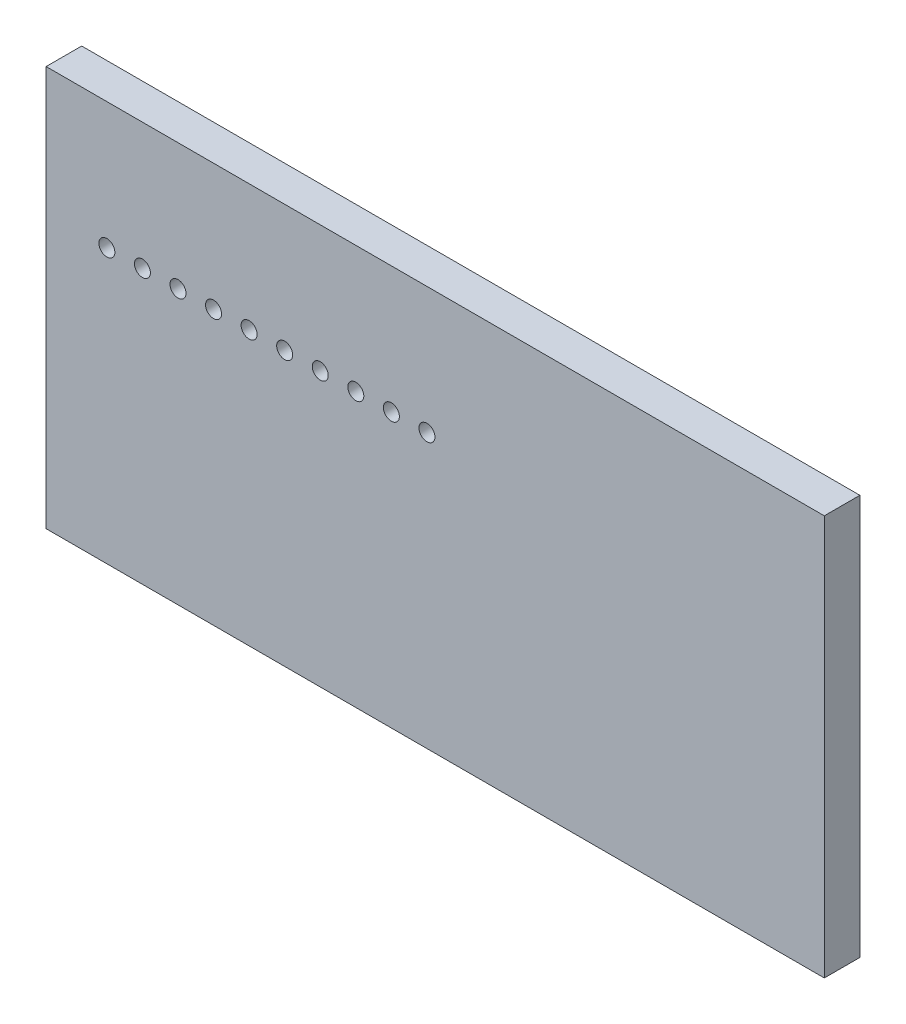
ISO-10303-21;
HEADER;
FILE_DESCRIPTION(('STEP AP214'),'2;1');
FILE_NAME('part.step','',(''),(''),'','','');
FILE_SCHEMA(('AUTOMOTIVE_DESIGN { 1 0 10303 214 1 1 1 1 }'));
ENDSEC;
DATA;
#1=APPLICATION_CONTEXT('core data for automotive mechanical design processes');
#2=APPLICATION_PROTOCOL_DEFINITION('international standard','automotive_design',2000,#1);
#3=PRODUCT_CONTEXT('',#1,'mechanical');
#4=PRODUCT('Part','Part','',(#3));
#5=PRODUCT_RELATED_PRODUCT_CATEGORY('part','',(#4));
#6=PRODUCT_DEFINITION_FORMATION('','',#4);
#7=PRODUCT_DEFINITION_CONTEXT('part definition',#1,'design');
#8=PRODUCT_DEFINITION('design','',#6,#7);
#9=PRODUCT_DEFINITION_SHAPE('','',#8);
#10=(LENGTH_UNIT() NAMED_UNIT(*) SI_UNIT(.MILLI.,.METRE.));
#11=(NAMED_UNIT(*) PLANE_ANGLE_UNIT() SI_UNIT($,.RADIAN.));
#12=(NAMED_UNIT(*) SI_UNIT($,.STERADIAN.) SOLID_ANGLE_UNIT());
#13=UNCERTAINTY_MEASURE_WITH_UNIT(LENGTH_MEASURE(1.E-05),#10,'distance_accuracy_value','');
#14=(GEOMETRIC_REPRESENTATION_CONTEXT(3) GLOBAL_UNCERTAINTY_ASSIGNED_CONTEXT((#13)) GLOBAL_UNIT_ASSIGNED_CONTEXT((#10,
#11,#12)) REPRESENTATION_CONTEXT('',''));
#15=CARTESIAN_POINT('',(0.,0.,0.));
#16=DIRECTION('',(0.,0.,1.));
#17=DIRECTION('',(1.,0.,0.));
#18=AXIS2_PLACEMENT_3D('',#15,#16,#17);
#19=CARTESIAN_POINT('',(-2.33233733232246,20.6904259891092,10.));
#20=DIRECTION('',(0.,0.,1.));
#21=DIRECTION('',(1.,0.,0.));
#22=AXIS2_PLACEMENT_3D('',#19,#20,#21);
#23=CYLINDRICAL_SURFACE('',#22,2.25);
#24=CARTESIAN_POINT('',(-2.33233733232246,20.6904259891092,0.));
#25=DIRECTION('',(0.,0.,1.));
#26=DIRECTION('',(1.,0.,0.));
#27=AXIS2_PLACEMENT_3D('',#24,#25,#26);
#28=CIRCLE('',#27,2.25);
#29=CARTESIAN_POINT('',(-0.0823373323224699,20.6904259891092,0.));
#30=VERTEX_POINT('',#29);
#31=EDGE_CURVE('E43',#30,#30,#28,.T.);
#32=ORIENTED_EDGE('',*,*,#31,.F.);
#33=EDGE_LOOP('',(#32));
#34=FACE_BOUND('',#33,.T.);
#35=CARTESIAN_POINT('',(-2.33233733232246,20.6904259891092,10.));
#36=DIRECTION('',(0.,0.,1.));
#37=DIRECTION('',(1.,0.,0.));
#38=AXIS2_PLACEMENT_3D('',#35,#36,#37);
#39=CIRCLE('',#38,2.24999999999999);
#40=CARTESIAN_POINT('',(-0.0823373323224769,20.6904259891092,10.));
#41=VERTEX_POINT('',#40);
#42=EDGE_CURVE('E11',#41,#41,#39,.T.);
#43=ORIENTED_EDGE('',*,*,#42,.T.);
#44=EDGE_LOOP('',(#43));
#45=FACE_BOUND('',#44,.T.);
#46=ADVANCED_FACE('F35',(#34,#45),#23,.F.);
#47=CARTESIAN_POINT('',(-12.3323373323225,20.6904259891092,10.));
#48=DIRECTION('',(0.,0.,1.));
#49=DIRECTION('',(1.,0.,0.));
#50=AXIS2_PLACEMENT_3D('',#47,#48,#49);
#51=CYLINDRICAL_SURFACE('',#50,2.25);
#52=CARTESIAN_POINT('',(-12.3323373323225,20.6904259891092,0.));
#53=DIRECTION('',(0.,0.,1.));
#54=DIRECTION('',(1.,0.,0.));
#55=AXIS2_PLACEMENT_3D('',#52,#53,#54);
#56=CIRCLE('',#55,2.25);
#57=CARTESIAN_POINT('',(-10.0823373323225,20.6904259891092,0.));
#58=VERTEX_POINT('',#57);
#59=EDGE_CURVE('E149',#58,#58,#56,.T.);
#60=ORIENTED_EDGE('',*,*,#59,.F.);
#61=EDGE_LOOP('',(#60));
#62=FACE_BOUND('',#61,.T.);
#63=CARTESIAN_POINT('',(-12.3323373323225,20.6904259891092,10.));
#64=DIRECTION('',(0.,0.,1.));
#65=DIRECTION('',(1.,0.,0.));
#66=AXIS2_PLACEMENT_3D('',#63,#64,#65);
#67=CIRCLE('',#66,2.24999999999999);
#68=CARTESIAN_POINT('',(-10.0823373323225,20.6904259891092,10.));
#69=VERTEX_POINT('',#68);
#70=EDGE_CURVE('E152',#69,#69,#67,.T.);
#71=ORIENTED_EDGE('',*,*,#70,.T.);
#72=EDGE_LOOP('',(#71));
#73=FACE_BOUND('',#72,.T.);
#74=ADVANCED_FACE('F161',(#62,#73),#51,.F.);
#75=CARTESIAN_POINT('',(-22.3323373323225,20.6904259891092,10.));
#76=DIRECTION('',(0.,0.,1.));
#77=DIRECTION('',(1.,0.,0.));
#78=AXIS2_PLACEMENT_3D('',#75,#76,#77);
#79=CYLINDRICAL_SURFACE('',#78,2.25);
#80=CARTESIAN_POINT('',(-22.3323373323225,20.6904259891092,0.));
#81=DIRECTION('',(0.,0.,1.));
#82=DIRECTION('',(1.,0.,0.));
#83=AXIS2_PLACEMENT_3D('',#80,#81,#82);
#84=CIRCLE('',#83,2.25);
#85=CARTESIAN_POINT('',(-20.0823373323225,20.6904259891092,0.));
#86=VERTEX_POINT('',#85);
#87=EDGE_CURVE('E143',#86,#86,#84,.T.);
#88=ORIENTED_EDGE('',*,*,#87,.F.);
#89=EDGE_LOOP('',(#88));
#90=FACE_BOUND('',#89,.T.);
#91=CARTESIAN_POINT('',(-22.3323373323225,20.6904259891092,10.));
#92=DIRECTION('',(0.,0.,1.));
#93=DIRECTION('',(1.,0.,0.));
#94=AXIS2_PLACEMENT_3D('',#91,#92,#93);
#95=CIRCLE('',#94,2.24999999999999);
#96=CARTESIAN_POINT('',(-20.0823373323225,20.6904259891092,10.));
#97=VERTEX_POINT('',#96);
#98=EDGE_CURVE('E146',#97,#97,#95,.T.);
#99=ORIENTED_EDGE('',*,*,#98,.T.);
#100=EDGE_LOOP('',(#99));
#101=FACE_BOUND('',#100,.T.);
#102=ADVANCED_FACE('F208',(#90,#101),#79,.F.);
#103=CARTESIAN_POINT('',(-32.3323373323225,20.6904259891092,10.));
#104=DIRECTION('',(0.,0.,1.));
#105=DIRECTION('',(1.,0.,0.));
#106=AXIS2_PLACEMENT_3D('',#103,#104,#105);
#107=CYLINDRICAL_SURFACE('',#106,2.25);
#108=CARTESIAN_POINT('',(-32.3323373323225,20.6904259891092,0.));
#109=DIRECTION('',(0.,0.,1.));
#110=DIRECTION('',(1.,0.,0.));
#111=AXIS2_PLACEMENT_3D('',#108,#109,#110);
#112=CIRCLE('',#111,2.25);
#113=CARTESIAN_POINT('',(-30.0823373323225,20.6904259891092,0.));
#114=VERTEX_POINT('',#113);
#115=EDGE_CURVE('E137',#114,#114,#112,.T.);
#116=ORIENTED_EDGE('',*,*,#115,.F.);
#117=EDGE_LOOP('',(#116));
#118=FACE_BOUND('',#117,.T.);
#119=CARTESIAN_POINT('',(-32.3323373323225,20.6904259891092,10.));
#120=DIRECTION('',(0.,0.,1.));
#121=DIRECTION('',(1.,0.,0.));
#122=AXIS2_PLACEMENT_3D('',#119,#120,#121);
#123=CIRCLE('',#122,2.24999999999999);
#124=CARTESIAN_POINT('',(-30.0823373323225,20.6904259891092,10.));
#125=VERTEX_POINT('',#124);
#126=EDGE_CURVE('E140',#125,#125,#123,.T.);
#127=ORIENTED_EDGE('',*,*,#126,.T.);
#128=EDGE_LOOP('',(#127));
#129=FACE_BOUND('',#128,.T.);
#130=ADVANCED_FACE('F204',(#118,#129),#107,.F.);
#131=CARTESIAN_POINT('',(-42.3323373323225,20.6904259891092,10.));
#132=DIRECTION('',(0.,0.,1.));
#133=DIRECTION('',(1.,0.,0.));
#134=AXIS2_PLACEMENT_3D('',#131,#132,#133);
#135=CYLINDRICAL_SURFACE('',#134,2.25);
#136=CARTESIAN_POINT('',(-42.3323373323225,20.6904259891092,0.));
#137=DIRECTION('',(0.,0.,1.));
#138=DIRECTION('',(1.,0.,0.));
#139=AXIS2_PLACEMENT_3D('',#136,#137,#138);
#140=CIRCLE('',#139,2.25);
#141=CARTESIAN_POINT('',(-40.0823373323225,20.6904259891092,0.));
#142=VERTEX_POINT('',#141);
#143=EDGE_CURVE('E131',#142,#142,#140,.T.);
#144=ORIENTED_EDGE('',*,*,#143,.F.);
#145=EDGE_LOOP('',(#144));
#146=FACE_BOUND('',#145,.T.);
#147=CARTESIAN_POINT('',(-42.3323373323225,20.6904259891092,10.));
#148=DIRECTION('',(0.,0.,1.));
#149=DIRECTION('',(1.,0.,0.));
#150=AXIS2_PLACEMENT_3D('',#147,#148,#149);
#151=CIRCLE('',#150,2.24999999999999);
#152=CARTESIAN_POINT('',(-40.0823373323225,20.6904259891092,10.));
#153=VERTEX_POINT('',#152);
#154=EDGE_CURVE('E134',#153,#153,#151,.T.);
#155=ORIENTED_EDGE('',*,*,#154,.T.);
#156=EDGE_LOOP('',(#155));
#157=FACE_BOUND('',#156,.T.);
#158=ADVANCED_FACE('F200',(#146,#157),#135,.F.);
#159=CARTESIAN_POINT('',(-52.3323373323225,20.6904259891092,10.));
#160=DIRECTION('',(0.,0.,1.));
#161=DIRECTION('',(1.,0.,0.));
#162=AXIS2_PLACEMENT_3D('',#159,#160,#161);
#163=CYLINDRICAL_SURFACE('',#162,2.25);
#164=CARTESIAN_POINT('',(-52.3323373323225,20.6904259891092,0.));
#165=DIRECTION('',(0.,0.,1.));
#166=DIRECTION('',(1.,0.,0.));
#167=AXIS2_PLACEMENT_3D('',#164,#165,#166);
#168=CIRCLE('',#167,2.25);
#169=CARTESIAN_POINT('',(-50.0823373323225,20.6904259891092,0.));
#170=VERTEX_POINT('',#169);
#171=EDGE_CURVE('E125',#170,#170,#168,.T.);
#172=ORIENTED_EDGE('',*,*,#171,.F.);
#173=EDGE_LOOP('',(#172));
#174=FACE_BOUND('',#173,.T.);
#175=CARTESIAN_POINT('',(-52.3323373323225,20.6904259891092,10.));
#176=DIRECTION('',(0.,0.,1.));
#177=DIRECTION('',(1.,0.,0.));
#178=AXIS2_PLACEMENT_3D('',#175,#176,#177);
#179=CIRCLE('',#178,2.24999999999999);
#180=CARTESIAN_POINT('',(-50.0823373323225,20.6904259891092,10.));
#181=VERTEX_POINT('',#180);
#182=EDGE_CURVE('E128',#181,#181,#179,.T.);
#183=ORIENTED_EDGE('',*,*,#182,.T.);
#184=EDGE_LOOP('',(#183));
#185=FACE_BOUND('',#184,.T.);
#186=ADVANCED_FACE('F196',(#174,#185),#163,.F.);
#187=CARTESIAN_POINT('',(-62.3323373323225,20.6904259891092,10.));
#188=DIRECTION('',(0.,0.,1.));
#189=DIRECTION('',(1.,0.,0.));
#190=AXIS2_PLACEMENT_3D('',#187,#188,#189);
#191=CYLINDRICAL_SURFACE('',#190,2.25);
#192=CARTESIAN_POINT('',(-62.3323373323225,20.6904259891092,0.));
#193=DIRECTION('',(0.,0.,1.));
#194=DIRECTION('',(1.,0.,0.));
#195=AXIS2_PLACEMENT_3D('',#192,#193,#194);
#196=CIRCLE('',#195,2.25);
#197=CARTESIAN_POINT('',(-60.0823373323225,20.6904259891092,0.));
#198=VERTEX_POINT('',#197);
#199=EDGE_CURVE('E119',#198,#198,#196,.T.);
#200=ORIENTED_EDGE('',*,*,#199,.F.);
#201=EDGE_LOOP('',(#200));
#202=FACE_BOUND('',#201,.T.);
#203=CARTESIAN_POINT('',(-62.3323373323225,20.6904259891092,10.));
#204=DIRECTION('',(0.,0.,1.));
#205=DIRECTION('',(1.,0.,0.));
#206=AXIS2_PLACEMENT_3D('',#203,#204,#205);
#207=CIRCLE('',#206,2.24999999999999);
#208=CARTESIAN_POINT('',(-60.0823373323225,20.6904259891092,10.));
#209=VERTEX_POINT('',#208);
#210=EDGE_CURVE('E122',#209,#209,#207,.T.);
#211=ORIENTED_EDGE('',*,*,#210,.T.);
#212=EDGE_LOOP('',(#211));
#213=FACE_BOUND('',#212,.T.);
#214=ADVANCED_FACE('F192',(#202,#213),#191,.F.);
#215=CARTESIAN_POINT('',(-72.3323373323225,20.6904259891092,10.));
#216=DIRECTION('',(0.,0.,1.));
#217=DIRECTION('',(1.,0.,0.));
#218=AXIS2_PLACEMENT_3D('',#215,#216,#217);
#219=CYLINDRICAL_SURFACE('',#218,2.25);
#220=CARTESIAN_POINT('',(-72.3323373323225,20.6904259891092,0.));
#221=DIRECTION('',(0.,0.,1.));
#222=DIRECTION('',(1.,0.,0.));
#223=AXIS2_PLACEMENT_3D('',#220,#221,#222);
#224=CIRCLE('',#223,2.25);
#225=CARTESIAN_POINT('',(-70.0823373323225,20.6904259891092,0.));
#226=VERTEX_POINT('',#225);
#227=EDGE_CURVE('E113',#226,#226,#224,.T.);
#228=ORIENTED_EDGE('',*,*,#227,.F.);
#229=EDGE_LOOP('',(#228));
#230=FACE_BOUND('',#229,.T.);
#231=CARTESIAN_POINT('',(-72.3323373323225,20.6904259891092,10.));
#232=DIRECTION('',(0.,0.,1.));
#233=DIRECTION('',(1.,0.,0.));
#234=AXIS2_PLACEMENT_3D('',#231,#232,#233);
#235=CIRCLE('',#234,2.24999999999999);
#236=CARTESIAN_POINT('',(-70.0823373323225,20.6904259891092,10.));
#237=VERTEX_POINT('',#236);
#238=EDGE_CURVE('E116',#237,#237,#235,.T.);
#239=ORIENTED_EDGE('',*,*,#238,.T.);
#240=EDGE_LOOP('',(#239));
#241=FACE_BOUND('',#240,.T.);
#242=ADVANCED_FACE('F188',(#230,#241),#219,.F.);
#243=CARTESIAN_POINT('',(109.412192725267,56.2783172195366,10.));
#244=DIRECTION('',(-1.,0.,0.));
#245=DIRECTION('',(0.,0.,1.));
#246=AXIS2_PLACEMENT_3D('',#243,#244,#245);
#247=PLANE('',#246);
#248=DIRECTION('',(0.,1.,0.));
#249=VECTOR('',#248,1.);
#250=CARTESIAN_POINT('',(109.412192725267,56.2783172195366,0.));
#251=LINE('',#250,#249);
#252=CARTESIAN_POINT('',(109.412192725267,-56.2783172195366,0.));
#253=VERTEX_POINT('',#252);
#254=CARTESIAN_POINT('',(109.412192725267,56.2783172195366,0.));
#255=VERTEX_POINT('',#254);
#256=EDGE_CURVE('E103',#253,#255,#251,.T.);
#257=ORIENTED_EDGE('',*,*,#256,.T.);
#258=DIRECTION('',(0.,0.,-1.));
#259=VECTOR('',#258,1.);
#260=CARTESIAN_POINT('',(109.412192725267,56.2783172195366,10.));
#261=LINE('',#260,#259);
#262=CARTESIAN_POINT('',(109.412192725267,56.2783172195366,10.));
#263=VERTEX_POINT('',#262);
#264=EDGE_CURVE('E94',#263,#255,#261,.T.);
#265=ORIENTED_EDGE('',*,*,#264,.F.);
#266=DIRECTION('',(0.,1.,0.));
#267=VECTOR('',#266,1.);
#268=CARTESIAN_POINT('',(109.412192725267,56.2783172195366,10.));
#269=LINE('',#268,#267);
#270=CARTESIAN_POINT('',(109.412192725267,-56.2783172195366,10.));
#271=VERTEX_POINT('',#270);
#272=EDGE_CURVE('E88',#271,#263,#269,.T.);
#273=ORIENTED_EDGE('',*,*,#272,.F.);
#274=DIRECTION('',(0.,0.,-1.));
#275=VECTOR('',#274,1.);
#276=CARTESIAN_POINT('',(109.412192725267,-56.2783172195366,10.));
#277=LINE('',#276,#275);
#278=EDGE_CURVE('E99',#271,#253,#277,.T.);
#279=ORIENTED_EDGE('',*,*,#278,.T.);
#280=EDGE_LOOP('',(#257,#265,#273,#279));
#281=FACE_BOUND('',#280,.T.);
#282=ADVANCED_FACE('F185',(#281),#247,.F.);
#283=CARTESIAN_POINT('',(-109.412192725267,56.2783172195366,10.));
#284=DIRECTION('',(0.,-1.,0.));
#285=DIRECTION('',(0.,0.,-1.));
#286=AXIS2_PLACEMENT_3D('',#283,#284,#285);
#287=PLANE('',#286);
#288=DIRECTION('',(-1.,0.,0.));
#289=VECTOR('',#288,1.);
#290=CARTESIAN_POINT('',(-109.412192725267,56.2783172195366,0.));
#291=LINE('',#290,#289);
#292=CARTESIAN_POINT('',(-109.412192725267,56.2783172195366,0.));
#293=VERTEX_POINT('',#292);
#294=EDGE_CURVE('E93',#255,#293,#291,.T.);
#295=ORIENTED_EDGE('',*,*,#294,.T.);
#296=DIRECTION('',(0.,0.,-1.));
#297=VECTOR('',#296,1.);
#298=CARTESIAN_POINT('',(-109.412192725267,56.2783172195366,10.));
#299=LINE('',#298,#297);
#300=CARTESIAN_POINT('',(-109.412192725267,56.2783172195366,10.));
#301=VERTEX_POINT('',#300);
#302=EDGE_CURVE('E91',#301,#293,#299,.T.);
#303=ORIENTED_EDGE('',*,*,#302,.F.);
#304=DIRECTION('',(-1.,0.,0.));
#305=VECTOR('',#304,1.);
#306=CARTESIAN_POINT('',(-109.412192725267,56.2783172195366,10.));
#307=LINE('',#306,#305);
#308=EDGE_CURVE('E82',#263,#301,#307,.T.);
#309=ORIENTED_EDGE('',*,*,#308,.F.);
#310=ORIENTED_EDGE('',*,*,#264,.T.);
#311=EDGE_LOOP('',(#295,#303,#309,#310));
#312=FACE_BOUND('',#311,.T.);
#313=ADVANCED_FACE('F92',(#312),#287,.F.);
#314=CARTESIAN_POINT('',(-109.412192725267,56.2783172195366,10.));
#315=DIRECTION('',(1.,0.,0.));
#316=DIRECTION('',(0.,0.,-1.));
#317=AXIS2_PLACEMENT_3D('',#314,#315,#316);
#318=PLANE('',#317);
#319=DIRECTION('',(0.,-1.,0.));
#320=VECTOR('',#319,1.);
#321=CARTESIAN_POINT('',(-109.412192725267,56.2783172195366,0.));
#322=LINE('',#321,#320);
#323=CARTESIAN_POINT('',(-109.412192725267,-56.2783172195366,0.));
#324=VERTEX_POINT('',#323);
#325=EDGE_CURVE('E68',#293,#324,#322,.T.);
#326=ORIENTED_EDGE('',*,*,#325,.T.);
#327=DIRECTION('',(0.,0.,-1.));
#328=VECTOR('',#327,1.);
#329=CARTESIAN_POINT('',(-109.412192725267,-56.2783172195366,10.));
#330=LINE('',#329,#328);
#331=CARTESIAN_POINT('',(-109.412192725267,-56.2783172195366,10.));
#332=VERTEX_POINT('',#331);
#333=EDGE_CURVE('E95',#332,#324,#330,.T.);
#334=ORIENTED_EDGE('',*,*,#333,.F.);
#335=DIRECTION('',(0.,-1.,0.));
#336=VECTOR('',#335,1.);
#337=CARTESIAN_POINT('',(-109.412192725267,56.2783172195366,10.));
#338=LINE('',#337,#336);
#339=EDGE_CURVE('E86',#301,#332,#338,.T.);
#340=ORIENTED_EDGE('',*,*,#339,.F.);
#341=ORIENTED_EDGE('',*,*,#302,.T.);
#342=EDGE_LOOP('',(#326,#334,#340,#341));
#343=FACE_BOUND('',#342,.T.);
#344=ADVANCED_FACE('F97',(#343),#318,.F.);
#345=CARTESIAN_POINT('',(-109.412192725267,-56.2783172195366,10.));
#346=DIRECTION('',(0.,1.,0.));
#347=DIRECTION('',(0.,0.,1.));
#348=AXIS2_PLACEMENT_3D('',#345,#346,#347);
#349=PLANE('',#348);
#350=DIRECTION('',(1.,0.,0.));
#351=VECTOR('',#350,1.);
#352=CARTESIAN_POINT('',(-109.412192725267,-56.2783172195366,0.));
#353=LINE('',#352,#351);
#354=EDGE_CURVE('E74',#324,#253,#353,.T.);
#355=ORIENTED_EDGE('',*,*,#354,.T.);
#356=ORIENTED_EDGE('',*,*,#278,.F.);
#357=DIRECTION('',(1.,0.,0.));
#358=VECTOR('',#357,1.);
#359=CARTESIAN_POINT('',(-109.412192725267,-56.2783172195366,10.));
#360=LINE('',#359,#358);
#361=EDGE_CURVE('E51',#332,#271,#360,.T.);
#362=ORIENTED_EDGE('',*,*,#361,.F.);
#363=ORIENTED_EDGE('',*,*,#333,.T.);
#364=EDGE_LOOP('',(#355,#356,#362,#363));
#365=FACE_BOUND('',#364,.T.);
#366=ADVANCED_FACE('F165',(#365),#349,.F.);
#367=CARTESIAN_POINT('',(0.,0.,10.));
#368=DIRECTION('',(0.,0.,1.));
#369=DIRECTION('',(1.,0.,0.));
#370=AXIS2_PLACEMENT_3D('',#367,#368,#369);
#371=PLANE('',#370);
#372=CARTESIAN_POINT('',(-82.3323373323225,20.6904259891092,10.));
#373=DIRECTION('',(0.,0.,1.));
#374=DIRECTION('',(1.,0.,0.));
#375=AXIS2_PLACEMENT_3D('',#372,#373,#374);
#376=CIRCLE('',#375,2.24999999999999);
#377=CARTESIAN_POINT('',(-80.0823373323225,20.6904259891092,10.));
#378=VERTEX_POINT('',#377);
#379=EDGE_CURVE('E317',#378,#378,#376,.T.);
#380=ORIENTED_EDGE('',*,*,#379,.F.);
#381=EDGE_LOOP('',(#380));
#382=FACE_BOUND('',#381,.T.);
#383=CARTESIAN_POINT('',(-92.3323373323225,20.6904259891092,10.));
#384=DIRECTION('',(0.,0.,1.));
#385=DIRECTION('',(1.,0.,0.));
#386=AXIS2_PLACEMENT_3D('',#383,#384,#385);
#387=CIRCLE('',#386,2.24999999999999);
#388=CARTESIAN_POINT('',(-90.0823373323225,20.6904259891092,10.));
#389=VERTEX_POINT('',#388);
#390=EDGE_CURVE('E318',#389,#389,#387,.T.);
#391=ORIENTED_EDGE('',*,*,#390,.F.);
#392=EDGE_LOOP('',(#391));
#393=FACE_BOUND('',#392,.T.);
#394=ORIENTED_EDGE('',*,*,#272,.T.);
#395=ORIENTED_EDGE('',*,*,#308,.T.);
#396=ORIENTED_EDGE('',*,*,#339,.T.);
#397=ORIENTED_EDGE('',*,*,#361,.T.);
#398=EDGE_LOOP('',(#394,#395,#396,#397));
#399=FACE_BOUND('',#398,.T.);
#400=ORIENTED_EDGE('',*,*,#238,.F.);
#401=EDGE_LOOP('',(#400));
#402=FACE_BOUND('',#401,.T.);
#403=ORIENTED_EDGE('',*,*,#210,.F.);
#404=EDGE_LOOP('',(#403));
#405=FACE_BOUND('',#404,.T.);
#406=ORIENTED_EDGE('',*,*,#182,.F.);
#407=EDGE_LOOP('',(#406));
#408=FACE_BOUND('',#407,.T.);
#409=ORIENTED_EDGE('',*,*,#154,.F.);
#410=EDGE_LOOP('',(#409));
#411=FACE_BOUND('',#410,.T.);
#412=ORIENTED_EDGE('',*,*,#126,.F.);
#413=EDGE_LOOP('',(#412));
#414=FACE_BOUND('',#413,.T.);
#415=ORIENTED_EDGE('',*,*,#98,.F.);
#416=EDGE_LOOP('',(#415));
#417=FACE_BOUND('',#416,.T.);
#418=ORIENTED_EDGE('',*,*,#70,.F.);
#419=EDGE_LOOP('',(#418));
#420=FACE_BOUND('',#419,.T.);
#421=ORIENTED_EDGE('',*,*,#42,.F.);
#422=EDGE_LOOP('',(#421));
#423=FACE_BOUND('',#422,.T.);
#424=ADVANCED_FACE('F83',(#382,#393,#399,#402,#405,#408,#411,#414,#417,#420,#423),#371,.T.);
#425=CARTESIAN_POINT('',(0.,0.,0.));
#426=DIRECTION('',(0.,0.,1.));
#427=DIRECTION('',(1.,0.,0.));
#428=AXIS2_PLACEMENT_3D('',#425,#426,#427);
#429=PLANE('',#428);
#430=CARTESIAN_POINT('',(-82.3323373323225,20.6904259891092,0.));
#431=DIRECTION('',(0.,0.,1.));
#432=DIRECTION('',(1.,0.,0.));
#433=AXIS2_PLACEMENT_3D('',#430,#431,#432);
#434=CIRCLE('',#433,2.25);
#435=CARTESIAN_POINT('',(-80.0823373323225,20.6904259891092,0.));
#436=VERTEX_POINT('',#435);
#437=EDGE_CURVE('E315',#436,#436,#434,.T.);
#438=ORIENTED_EDGE('',*,*,#437,.T.);
#439=EDGE_LOOP('',(#438));
#440=FACE_BOUND('',#439,.T.);
#441=CARTESIAN_POINT('',(-92.3323373323225,20.6904259891092,0.));
#442=DIRECTION('',(0.,0.,1.));
#443=DIRECTION('',(1.,0.,0.));
#444=AXIS2_PLACEMENT_3D('',#441,#442,#443);
#445=CIRCLE('',#444,2.25);
#446=CARTESIAN_POINT('',(-90.0823373323225,20.6904259891092,0.));
#447=VERTEX_POINT('',#446);
#448=EDGE_CURVE('E106',#447,#447,#445,.T.);
#449=ORIENTED_EDGE('',*,*,#448,.T.);
#450=EDGE_LOOP('',(#449));
#451=FACE_BOUND('',#450,.T.);
#452=ORIENTED_EDGE('',*,*,#256,.F.);
#453=ORIENTED_EDGE('',*,*,#354,.F.);
#454=ORIENTED_EDGE('',*,*,#325,.F.);
#455=ORIENTED_EDGE('',*,*,#294,.F.);
#456=EDGE_LOOP('',(#452,#453,#454,#455));
#457=FACE_BOUND('',#456,.T.);
#458=ORIENTED_EDGE('',*,*,#227,.T.);
#459=EDGE_LOOP('',(#458));
#460=FACE_BOUND('',#459,.T.);
#461=ORIENTED_EDGE('',*,*,#199,.T.);
#462=EDGE_LOOP('',(#461));
#463=FACE_BOUND('',#462,.T.);
#464=ORIENTED_EDGE('',*,*,#171,.T.);
#465=EDGE_LOOP('',(#464));
#466=FACE_BOUND('',#465,.T.);
#467=ORIENTED_EDGE('',*,*,#143,.T.);
#468=EDGE_LOOP('',(#467));
#469=FACE_BOUND('',#468,.T.);
#470=ORIENTED_EDGE('',*,*,#115,.T.);
#471=EDGE_LOOP('',(#470));
#472=FACE_BOUND('',#471,.T.);
#473=ORIENTED_EDGE('',*,*,#87,.T.);
#474=EDGE_LOOP('',(#473));
#475=FACE_BOUND('',#474,.T.);
#476=ORIENTED_EDGE('',*,*,#59,.T.);
#477=EDGE_LOOP('',(#476));
#478=FACE_BOUND('',#477,.T.);
#479=ORIENTED_EDGE('',*,*,#31,.T.);
#480=EDGE_LOOP('',(#479));
#481=FACE_BOUND('',#480,.T.);
#482=ADVANCED_FACE('F157',(#440,#451,#457,#460,#463,#466,#469,#472,#475,#478,#481),#429,.F.);
#483=CARTESIAN_POINT('',(-92.3323373323225,20.6904259891092,10.));
#484=DIRECTION('',(0.,0.,1.));
#485=DIRECTION('',(1.,0.,0.));
#486=AXIS2_PLACEMENT_3D('',#483,#484,#485);
#487=CYLINDRICAL_SURFACE('',#486,2.25);
#488=ORIENTED_EDGE('',*,*,#448,.F.);
#489=EDGE_LOOP('',(#488));
#490=FACE_BOUND('',#489,.T.);
#491=ORIENTED_EDGE('',*,*,#390,.T.);
#492=EDGE_LOOP('',(#491));
#493=FACE_BOUND('',#492,.T.);
#494=ADVANCED_FACE('F172',(#490,#493),#487,.F.);
#495=CARTESIAN_POINT('',(-82.3323373323225,20.6904259891092,10.));
#496=DIRECTION('',(0.,0.,1.));
#497=DIRECTION('',(1.,0.,0.));
#498=AXIS2_PLACEMENT_3D('',#495,#496,#497);
#499=CYLINDRICAL_SURFACE('',#498,2.25);
#500=ORIENTED_EDGE('',*,*,#437,.F.);
#501=EDGE_LOOP('',(#500));
#502=FACE_BOUND('',#501,.T.);
#503=ORIENTED_EDGE('',*,*,#379,.T.);
#504=EDGE_LOOP('',(#503));
#505=FACE_BOUND('',#504,.T.);
#506=ADVANCED_FACE('F272',(#502,#505),#499,.F.);
#507=CLOSED_SHELL('',(#46,#74,#102,#130,#158,#186,#214,#242,#282,#313,#344,#366,#424,#482,#494,#506));
#508=MANIFOLD_SOLID_BREP('B2',#507);
#509=ADVANCED_BREP_SHAPE_REPRESENTATION('',(#18,#508),#14);
#510=SHAPE_DEFINITION_REPRESENTATION(#9,#509);
ENDSEC;
END-ISO-10303-21;
